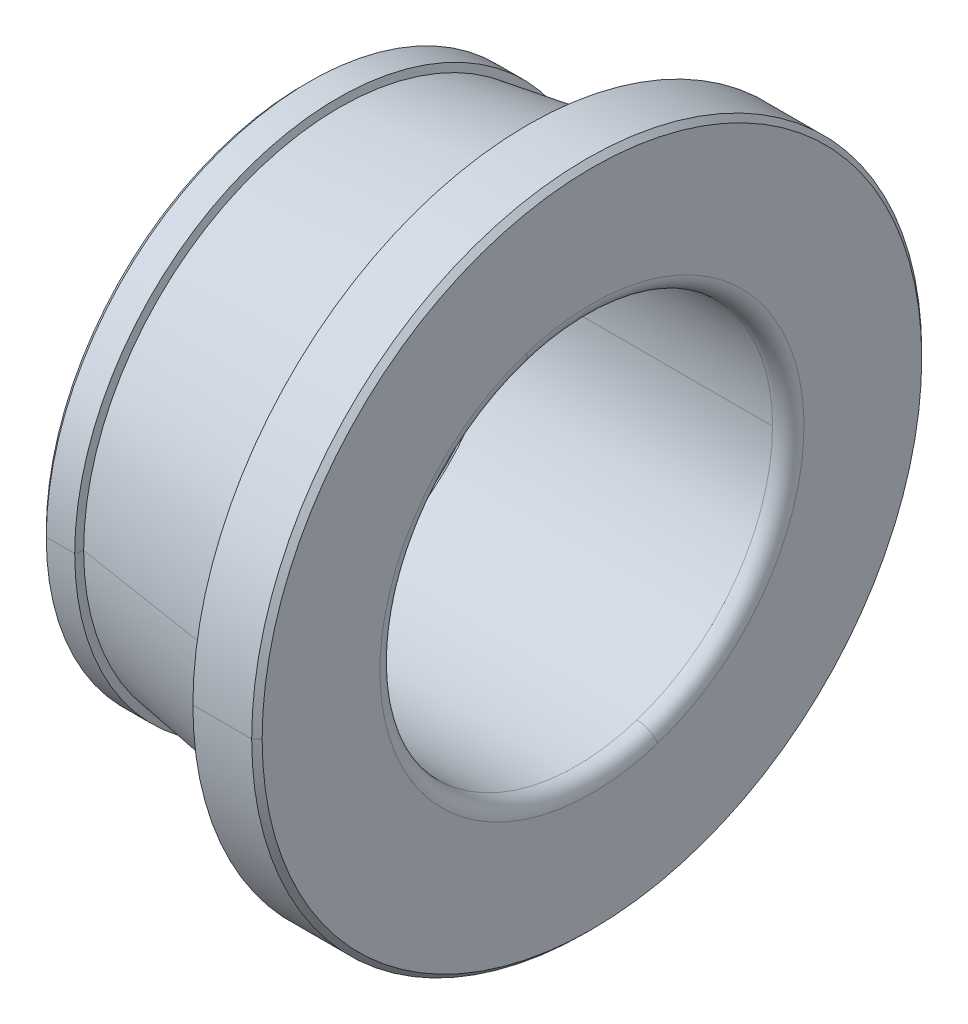
ISO-10303-21;
HEADER;
FILE_DESCRIPTION(('STEP AP214'),'2;1');
FILE_NAME('part.step','',(''),(''),'','','');
FILE_SCHEMA(('AUTOMOTIVE_DESIGN { 1 0 10303 214 1 1 1 1 }'));
ENDSEC;
DATA;
#1=APPLICATION_CONTEXT('core data for automotive mechanical design processes');
#2=APPLICATION_PROTOCOL_DEFINITION('international standard','automotive_design',2000,#1);
#3=PRODUCT_CONTEXT('',#1,'mechanical');
#4=PRODUCT('Part','Part','',(#3));
#5=PRODUCT_RELATED_PRODUCT_CATEGORY('part','',(#4));
#6=PRODUCT_DEFINITION_FORMATION('','',#4);
#7=PRODUCT_DEFINITION_CONTEXT('part definition',#1,'design');
#8=PRODUCT_DEFINITION('design','',#6,#7);
#9=PRODUCT_DEFINITION_SHAPE('','',#8);
#10=(LENGTH_UNIT() NAMED_UNIT(*) SI_UNIT(.MILLI.,.METRE.));
#11=(NAMED_UNIT(*) PLANE_ANGLE_UNIT() SI_UNIT($,.RADIAN.));
#12=(NAMED_UNIT(*) SI_UNIT($,.STERADIAN.) SOLID_ANGLE_UNIT());
#13=UNCERTAINTY_MEASURE_WITH_UNIT(LENGTH_MEASURE(1.E-05),#10,'distance_accuracy_value','');
#14=(GEOMETRIC_REPRESENTATION_CONTEXT(3) GLOBAL_UNCERTAINTY_ASSIGNED_CONTEXT((#13)) GLOBAL_UNIT_ASSIGNED_CONTEXT((#10,
#11,#12)) REPRESENTATION_CONTEXT('',''));
#15=CARTESIAN_POINT('',(0.,0.,0.));
#16=DIRECTION('',(0.,0.,1.));
#17=DIRECTION('',(1.,0.,0.));
#18=AXIS2_PLACEMENT_3D('',#15,#16,#17);
#19=CARTESIAN_POINT('',(0.75,9.848,0.));
#20=DIRECTION('',(-1.,0.,0.));
#21=DIRECTION('',(0.,0.,1.));
#22=AXIS2_PLACEMENT_3D('',#19,#20,#21);
#23=PLANE('',#22);
#24=CARTESIAN_POINT('',(0.75,0.,0.));
#25=DIRECTION('',(1.,0.,0.));
#26=DIRECTION('',(0.,0.,-1.));
#27=AXIS2_PLACEMENT_3D('',#24,#25,#26);
#28=CIRCLE('',#27,7.7);
#29=CARTESIAN_POINT('',(0.75,0.,-7.7));
#30=VERTEX_POINT('',#29);
#31=CARTESIAN_POINT('',(0.75,0.,7.7));
#32=VERTEX_POINT('',#31);
#33=EDGE_CURVE('E10',#30,#32,#28,.T.);
#34=ORIENTED_EDGE('',*,*,#33,.T.);
#35=CARTESIAN_POINT('',(0.75,0.,0.));
#36=DIRECTION('',(1.,0.,0.));
#37=DIRECTION('',(0.,0.,-1.));
#38=AXIS2_PLACEMENT_3D('',#35,#36,#37);
#39=CIRCLE('',#38,7.7);
#40=EDGE_CURVE('E24',#32,#30,#39,.T.);
#41=ORIENTED_EDGE('',*,*,#40,.T.);
#42=EDGE_LOOP('',(#34,#41));
#43=FACE_BOUND('',#42,.T.);
#44=CARTESIAN_POINT('',(0.75,0.,0.));
#45=DIRECTION('',(1.,0.,0.));
#46=DIRECTION('',(0.,0.,-1.));
#47=AXIS2_PLACEMENT_3D('',#44,#45,#46);
#48=CIRCLE('',#47,9.848);
#49=CARTESIAN_POINT('',(0.749999999999999,0.,9.848));
#50=VERTEX_POINT('',#49);
#51=CARTESIAN_POINT('',(0.75,0.,-9.848));
#52=VERTEX_POINT('',#51);
#53=EDGE_CURVE('E370',#50,#52,#48,.T.);
#54=ORIENTED_EDGE('',*,*,#53,.F.);
#55=CARTESIAN_POINT('',(0.75,0.,0.));
#56=DIRECTION('',(1.,0.,0.));
#57=DIRECTION('',(0.,0.,-1.));
#58=AXIS2_PLACEMENT_3D('',#55,#56,#57);
#59=CIRCLE('',#58,9.848);
#60=EDGE_CURVE('E365',#52,#50,#59,.T.);
#61=ORIENTED_EDGE('',*,*,#60,.F.);
#62=EDGE_LOOP('',(#54,#61));
#63=FACE_BOUND('',#62,.T.);
#64=ADVANCED_FACE('F16',(#43,#63),#23,.T.);
#65=CARTESIAN_POINT('',(0.95,0.,0.));
#66=DIRECTION('',(1.,0.,0.));
#67=DIRECTION('',(0.,-1.,0.));
#68=AXIS2_PLACEMENT_3D('',#65,#66,#67);
#69=CONICAL_SURFACE('',#68,10.048,0.785398163397448);
#70=DIRECTION('',(0.707106781186548,0.,0.707106781186548));
#71=VECTOR('',#70,1.);
#72=CARTESIAN_POINT('',(0.749999999999999,0.,9.848));
#73=LINE('',#72,#71);
#74=CARTESIAN_POINT('',(0.949999999999999,0.,10.048));
#75=VERTEX_POINT('',#74);
#76=EDGE_CURVE('E361',#50,#75,#73,.T.);
#77=ORIENTED_EDGE('',*,*,#76,.T.);
#78=CARTESIAN_POINT('',(0.95,0.,0.));
#79=DIRECTION('',(1.,0.,0.));
#80=DIRECTION('',(0.,0.,-1.));
#81=AXIS2_PLACEMENT_3D('',#78,#79,#80);
#82=CIRCLE('',#81,10.048);
#83=CARTESIAN_POINT('',(0.95,0.,-10.048));
#84=VERTEX_POINT('',#83);
#85=EDGE_CURVE('E356',#84,#75,#82,.T.);
#86=ORIENTED_EDGE('',*,*,#85,.F.);
#87=DIRECTION('',(0.707106781186548,0.,-0.707106781186548));
#88=VECTOR('',#87,1.);
#89=CARTESIAN_POINT('',(0.749999999999999,0.,-9.848));
#90=LINE('',#89,#88);
#91=EDGE_CURVE('E351',#52,#84,#90,.T.);
#92=ORIENTED_EDGE('',*,*,#91,.F.);
#93=ORIENTED_EDGE('',*,*,#60,.T.);
#94=EDGE_LOOP('',(#77,#86,#92,#93));
#95=FACE_BOUND('',#94,.T.);
#96=ADVANCED_FACE('F386',(#95),#69,.T.);
#97=CARTESIAN_POINT('',(0.95,0.,0.));
#98=DIRECTION('',(1.,0.,0.));
#99=DIRECTION('',(0.,1.,0.));
#100=AXIS2_PLACEMENT_3D('',#97,#98,#99);
#101=CONICAL_SURFACE('',#100,10.048,0.785398163397448);
#102=ORIENTED_EDGE('',*,*,#76,.F.);
#103=ORIENTED_EDGE('',*,*,#53,.T.);
#104=ORIENTED_EDGE('',*,*,#91,.T.);
#105=CARTESIAN_POINT('',(0.95,0.,0.));
#106=DIRECTION('',(1.,0.,0.));
#107=DIRECTION('',(0.,0.,-1.));
#108=AXIS2_PLACEMENT_3D('',#105,#106,#107);
#109=CIRCLE('',#108,10.048);
#110=EDGE_CURVE('E346',#75,#84,#109,.T.);
#111=ORIENTED_EDGE('',*,*,#110,.F.);
#112=EDGE_LOOP('',(#102,#103,#104,#111));
#113=FACE_BOUND('',#112,.T.);
#114=ADVANCED_FACE('F381',(#113),#101,.T.);
#115=CARTESIAN_POINT('',(11.75,0.,0.));
#116=DIRECTION('',(1.,0.,0.));
#117=DIRECTION('',(0.,1.,-7.04598063582105E-12));
#118=AXIS2_PLACEMENT_3D('',#115,#116,#117);
#119=CYLINDRICAL_SURFACE('',#118,10.048);
#120=DIRECTION('',(1.,0.,0.));
#121=VECTOR('',#120,1.);
#122=CARTESIAN_POINT('',(0.949999999999999,0.,10.048));
#123=LINE('',#122,#121);
#124=CARTESIAN_POINT('',(2.0365056005658,0.,10.048));
#125=VERTEX_POINT('',#124);
#126=EDGE_CURVE('E341',#75,#125,#123,.T.);
#127=ORIENTED_EDGE('',*,*,#126,.F.);
#128=ORIENTED_EDGE('',*,*,#110,.T.);
#129=DIRECTION('',(1.,0.,0.));
#130=VECTOR('',#129,1.);
#131=CARTESIAN_POINT('',(0.949999999999999,0.,-10.048));
#132=LINE('',#131,#130);
#133=CARTESIAN_POINT('',(2.0365056005658,0.,-10.048));
#134=VERTEX_POINT('',#133);
#135=EDGE_CURVE('E337',#84,#134,#132,.T.);
#136=ORIENTED_EDGE('',*,*,#135,.T.);
#137=CARTESIAN_POINT('',(2.0365056005658,0.,0.));
#138=DIRECTION('',(1.,0.,0.));
#139=DIRECTION('',(0.,0.,-1.));
#140=AXIS2_PLACEMENT_3D('',#137,#138,#139);
#141=CIRCLE('',#140,10.048);
#142=EDGE_CURVE('E332',#125,#134,#141,.T.);
#143=ORIENTED_EDGE('',*,*,#142,.F.);
#144=EDGE_LOOP('',(#127,#128,#136,#143));
#145=FACE_BOUND('',#144,.T.);
#146=ADVANCED_FACE('F393',(#145),#119,.T.);
#147=CARTESIAN_POINT('',(2.1006162076405,0.,0.));
#148=DIRECTION('',(-1.,0.,0.));
#149=DIRECTION('',(0.,1.,0.));
#150=AXIS2_PLACEMENT_3D('',#147,#148,#149);
#151=CONICAL_SURFACE('',#150,9.7703064521703,1.34390352403557);
#152=DIRECTION('',(-0.224951054343929,0.,-0.97437006478522));
#153=VECTOR('',#152,1.);
#154=CARTESIAN_POINT('',(2.1006162076405,0.,-9.7703064521703));
#155=LINE('',#154,#153);
#156=CARTESIAN_POINT('',(2.1006162076405,0.,-9.7703064521703));
#157=VERTEX_POINT('',#156);
#158=EDGE_CURVE('E327',#157,#134,#155,.T.);
#159=ORIENTED_EDGE('',*,*,#158,.F.);
#160=CARTESIAN_POINT('',(2.1006162076405,0.,0.));
#161=DIRECTION('',(1.,0.,0.));
#162=DIRECTION('',(0.,0.,-1.));
#163=AXIS2_PLACEMENT_3D('',#160,#161,#162);
#164=CIRCLE('',#163,9.7703064521703);
#165=CARTESIAN_POINT('',(2.1006162076405,0.,9.7703064521703));
#166=VERTEX_POINT('',#165);
#167=EDGE_CURVE('E322',#166,#157,#164,.T.);
#168=ORIENTED_EDGE('',*,*,#167,.F.);
#169=DIRECTION('',(-0.224951054343929,0.,0.97437006478522));
#170=VECTOR('',#169,1.);
#171=CARTESIAN_POINT('',(2.1006162076405,0.,9.7703064521703));
#172=LINE('',#171,#170);
#173=EDGE_CURVE('E317',#166,#125,#172,.T.);
#174=ORIENTED_EDGE('',*,*,#173,.T.);
#175=ORIENTED_EDGE('',*,*,#142,.T.);
#176=EDGE_LOOP('',(#159,#168,#174,#175));
#177=FACE_BOUND('',#176,.T.);
#178=ADVANCED_FACE('F395',(#177),#151,.T.);
#179=CARTESIAN_POINT('',(2.1006162076405,0.,0.));
#180=DIRECTION('',(-1.,0.,0.));
#181=DIRECTION('',(0.,-1.,0.));
#182=AXIS2_PLACEMENT_3D('',#179,#180,#181);
#183=CONICAL_SURFACE('',#182,9.7703064521703,1.34390352403557);
#184=ORIENTED_EDGE('',*,*,#158,.T.);
#185=CARTESIAN_POINT('',(2.0365056005658,0.,0.));
#186=DIRECTION('',(1.,0.,0.));
#187=DIRECTION('',(0.,0.,-1.));
#188=AXIS2_PLACEMENT_3D('',#185,#186,#187);
#189=CIRCLE('',#188,10.048);
#190=EDGE_CURVE('E312',#134,#125,#189,.T.);
#191=ORIENTED_EDGE('',*,*,#190,.T.);
#192=ORIENTED_EDGE('',*,*,#173,.F.);
#193=CARTESIAN_POINT('',(2.1006162076405,0.,0.));
#194=DIRECTION('',(1.,0.,0.));
#195=DIRECTION('',(0.,0.,-1.));
#196=AXIS2_PLACEMENT_3D('',#193,#194,#195);
#197=CIRCLE('',#196,9.7703064521703);
#198=EDGE_CURVE('E307',#157,#166,#197,.T.);
#199=ORIENTED_EDGE('',*,*,#198,.F.);
#200=EDGE_LOOP('',(#184,#191,#192,#199));
#201=FACE_BOUND('',#200,.T.);
#202=ADVANCED_FACE('F400',(#201),#183,.T.);
#203=CARTESIAN_POINT('',(9.7247521082979,0.,0.));
#204=DIRECTION('',(1.,0.,0.));
#205=DIRECTION('',(0.,-1.,0.));
#206=AXIS2_PLACEMENT_3D('',#203,#204,#205);
#207=CONICAL_SURFACE('',#206,10.97621415212,0.156870193169296);
#208=DIRECTION('',(0.987721082490204,0.,0.156227600648473));
#209=VECTOR('',#208,1.);
#210=CARTESIAN_POINT('',(2.10061620764049,0.,9.7703064521703));
#211=LINE('',#210,#209);
#212=CARTESIAN_POINT('',(9.7247521082979,0.,10.97621415212));
#213=VERTEX_POINT('',#212);
#214=EDGE_CURVE('E303',#166,#213,#211,.T.);
#215=ORIENTED_EDGE('',*,*,#214,.T.);
#216=CARTESIAN_POINT('',(9.7247521082979,0.,0.));
#217=DIRECTION('',(1.,0.,0.));
#218=DIRECTION('',(0.,0.,-1.));
#219=AXIS2_PLACEMENT_3D('',#216,#217,#218);
#220=CIRCLE('',#219,10.97621415212);
#221=CARTESIAN_POINT('',(9.7247521082979,0.,-10.97621415212));
#222=VERTEX_POINT('',#221);
#223=EDGE_CURVE('E298',#222,#213,#220,.T.);
#224=ORIENTED_EDGE('',*,*,#223,.F.);
#225=DIRECTION('',(0.987721082490204,0.,-0.156227600648473));
#226=VECTOR('',#225,1.);
#227=CARTESIAN_POINT('',(2.10061620764049,0.,-9.7703064521703));
#228=LINE('',#227,#226);
#229=EDGE_CURVE('E293',#157,#222,#228,.T.);
#230=ORIENTED_EDGE('',*,*,#229,.F.);
#231=ORIENTED_EDGE('',*,*,#198,.T.);
#232=EDGE_LOOP('',(#215,#224,#230,#231));
#233=FACE_BOUND('',#232,.T.);
#234=ADVANCED_FACE('F407',(#233),#207,.T.);
#235=CARTESIAN_POINT('',(9.7247521082979,0.,0.));
#236=DIRECTION('',(1.,0.,0.));
#237=DIRECTION('',(0.,1.,0.));
#238=AXIS2_PLACEMENT_3D('',#235,#236,#237);
#239=CONICAL_SURFACE('',#238,10.97621415212,0.156870193169296);
#240=ORIENTED_EDGE('',*,*,#214,.F.);
#241=ORIENTED_EDGE('',*,*,#167,.T.);
#242=ORIENTED_EDGE('',*,*,#229,.T.);
#243=CARTESIAN_POINT('',(9.7247521082979,0.,0.));
#244=DIRECTION('',(1.,0.,0.));
#245=DIRECTION('',(0.,0.,-1.));
#246=AXIS2_PLACEMENT_3D('',#243,#244,#245);
#247=CIRCLE('',#246,10.97621415212);
#248=EDGE_CURVE('E288',#213,#222,#247,.T.);
#249=ORIENTED_EDGE('',*,*,#248,.F.);
#250=EDGE_LOOP('',(#240,#241,#242,#249));
#251=FACE_BOUND('',#250,.T.);
#252=ADVANCED_FACE('F404',(#251),#239,.T.);
#253=CARTESIAN_POINT('',(9.3036979685974,0.,0.));
#254=DIRECTION('',(-1.,0.,0.));
#255=DIRECTION('',(0.,1.,0.));
#256=AXIS2_PLACEMENT_3D('',#253,#254,#255);
#257=CONICAL_SURFACE('',#256,12.8,1.34390352403561);
#258=DIRECTION('',(-0.224951054343887,0.,-0.97437006478523));
#259=VECTOR('',#258,1.);
#260=CARTESIAN_POINT('',(9.7247521082979,0.,-10.97621415212));
#261=LINE('',#260,#259);
#262=CARTESIAN_POINT('',(9.3036979685974,0.,-12.8));
#263=VERTEX_POINT('',#262);
#264=EDGE_CURVE('E284',#222,#263,#261,.T.);
#265=ORIENTED_EDGE('',*,*,#264,.T.);
#266=CARTESIAN_POINT('',(9.3036979685974,0.,0.));
#267=DIRECTION('',(1.,0.,0.));
#268=DIRECTION('',(0.,0.,-1.));
#269=AXIS2_PLACEMENT_3D('',#266,#267,#268);
#270=CIRCLE('',#269,12.8);
#271=CARTESIAN_POINT('',(9.3036979685974,0.,12.8));
#272=VERTEX_POINT('',#271);
#273=EDGE_CURVE('E279',#272,#263,#270,.T.);
#274=ORIENTED_EDGE('',*,*,#273,.F.);
#275=DIRECTION('',(-0.224951054343887,0.,0.97437006478523));
#276=VECTOR('',#275,1.);
#277=CARTESIAN_POINT('',(9.7247521082979,0.,10.97621415212));
#278=LINE('',#277,#276);
#279=EDGE_CURVE('E274',#213,#272,#278,.T.);
#280=ORIENTED_EDGE('',*,*,#279,.F.);
#281=ORIENTED_EDGE('',*,*,#248,.T.);
#282=EDGE_LOOP('',(#265,#274,#280,#281));
#283=FACE_BOUND('',#282,.T.);
#284=ADVANCED_FACE('F409',(#283),#257,.F.);
#285=CARTESIAN_POINT('',(9.3036979685974,0.,0.));
#286=DIRECTION('',(-1.,0.,0.));
#287=DIRECTION('',(0.,-1.,0.));
#288=AXIS2_PLACEMENT_3D('',#285,#286,#287);
#289=CONICAL_SURFACE('',#288,12.8,1.34390352403561);
#290=ORIENTED_EDGE('',*,*,#264,.F.);
#291=ORIENTED_EDGE('',*,*,#223,.T.);
#292=ORIENTED_EDGE('',*,*,#279,.T.);
#293=CARTESIAN_POINT('',(9.3036979685974,0.,0.));
#294=DIRECTION('',(1.,0.,0.));
#295=DIRECTION('',(0.,0.,-1.));
#296=AXIS2_PLACEMENT_3D('',#293,#294,#295);
#297=CIRCLE('',#296,12.8);
#298=EDGE_CURVE('E269',#263,#272,#297,.T.);
#299=ORIENTED_EDGE('',*,*,#298,.F.);
#300=EDGE_LOOP('',(#290,#291,#292,#299));
#301=FACE_BOUND('',#300,.T.);
#302=ADVANCED_FACE('F414',(#301),#289,.F.);
#303=CARTESIAN_POINT('',(11.75,0.,0.));
#304=DIRECTION('',(1.,0.,0.));
#305=DIRECTION('',(0.,-1.,-2.35773084743394E-12));
#306=AXIS2_PLACEMENT_3D('',#303,#304,#305);
#307=CYLINDRICAL_SURFACE('',#306,12.8);
#308=DIRECTION('',(1.,0.,0.));
#309=VECTOR('',#308,1.);
#310=CARTESIAN_POINT('',(9.3036979685974,0.,12.8));
#311=LINE('',#310,#309);
#312=CARTESIAN_POINT('',(11.55,0.,12.8));
#313=VERTEX_POINT('',#312);
#314=EDGE_CURVE('E265',#272,#313,#311,.T.);
#315=ORIENTED_EDGE('',*,*,#314,.T.);
#316=CARTESIAN_POINT('',(11.55,0.,0.));
#317=DIRECTION('',(1.,0.,0.));
#318=DIRECTION('',(0.,0.,-1.));
#319=AXIS2_PLACEMENT_3D('',#316,#317,#318);
#320=CIRCLE('',#319,12.8);
#321=CARTESIAN_POINT('',(11.55,0.,-12.8));
#322=VERTEX_POINT('',#321);
#323=EDGE_CURVE('E260',#322,#313,#320,.T.);
#324=ORIENTED_EDGE('',*,*,#323,.F.);
#325=DIRECTION('',(1.,0.,0.));
#326=VECTOR('',#325,1.);
#327=CARTESIAN_POINT('',(9.3036979685974,0.,-12.8));
#328=LINE('',#327,#326);
#329=EDGE_CURVE('E255',#263,#322,#328,.T.);
#330=ORIENTED_EDGE('',*,*,#329,.F.);
#331=ORIENTED_EDGE('',*,*,#298,.T.);
#332=EDGE_LOOP('',(#315,#324,#330,#331));
#333=FACE_BOUND('',#332,.T.);
#334=ADVANCED_FACE('F420',(#333),#307,.T.);
#335=CARTESIAN_POINT('',(11.75,0.,0.));
#336=DIRECTION('',(1.,0.,0.));
#337=DIRECTION('',(0.,1.,0.));
#338=AXIS2_PLACEMENT_3D('',#335,#336,#337);
#339=CYLINDRICAL_SURFACE('',#338,12.8);
#340=ORIENTED_EDGE('',*,*,#314,.F.);
#341=ORIENTED_EDGE('',*,*,#273,.T.);
#342=ORIENTED_EDGE('',*,*,#329,.T.);
#343=CARTESIAN_POINT('',(11.55,0.,0.));
#344=DIRECTION('',(1.,0.,0.));
#345=DIRECTION('',(0.,0.,-1.));
#346=AXIS2_PLACEMENT_3D('',#343,#344,#345);
#347=CIRCLE('',#346,12.8);
#348=EDGE_CURVE('E250',#313,#322,#347,.T.);
#349=ORIENTED_EDGE('',*,*,#348,.F.);
#350=EDGE_LOOP('',(#340,#341,#342,#349));
#351=FACE_BOUND('',#350,.T.);
#352=ADVANCED_FACE('F418',(#351),#339,.T.);
#353=CARTESIAN_POINT('',(11.75,0.,0.));
#354=DIRECTION('',(-1.,0.,0.));
#355=DIRECTION('',(0.,1.,0.));
#356=AXIS2_PLACEMENT_3D('',#353,#354,#355);
#357=CONICAL_SURFACE('',#356,12.6,0.785398163397452);
#358=DIRECTION('',(-0.707106781186544,0.,-0.707106781186551));
#359=VECTOR('',#358,1.);
#360=CARTESIAN_POINT('',(11.75,0.,-12.6));
#361=LINE('',#360,#359);
#362=CARTESIAN_POINT('',(11.75,0.,-12.6));
#363=VERTEX_POINT('',#362);
#364=EDGE_CURVE('E245',#363,#322,#361,.T.);
#365=ORIENTED_EDGE('',*,*,#364,.F.);
#366=CARTESIAN_POINT('',(11.75,0.,0.));
#367=DIRECTION('',(1.,0.,0.));
#368=DIRECTION('',(0.,0.,-1.));
#369=AXIS2_PLACEMENT_3D('',#366,#367,#368);
#370=CIRCLE('',#369,12.6);
#371=CARTESIAN_POINT('',(11.75,0.,12.6));
#372=VERTEX_POINT('',#371);
#373=EDGE_CURVE('E240',#372,#363,#370,.T.);
#374=ORIENTED_EDGE('',*,*,#373,.F.);
#375=DIRECTION('',(-0.707106781186544,0.,0.707106781186551));
#376=VECTOR('',#375,1.);
#377=CARTESIAN_POINT('',(11.75,0.,12.6));
#378=LINE('',#377,#376);
#379=EDGE_CURVE('E235',#372,#313,#378,.T.);
#380=ORIENTED_EDGE('',*,*,#379,.T.);
#381=ORIENTED_EDGE('',*,*,#348,.T.);
#382=EDGE_LOOP('',(#365,#374,#380,#381));
#383=FACE_BOUND('',#382,.T.);
#384=ADVANCED_FACE('F426',(#383),#357,.T.);
#385=CARTESIAN_POINT('',(11.75,0.,0.));
#386=DIRECTION('',(-1.,0.,0.));
#387=DIRECTION('',(0.,-1.,0.));
#388=AXIS2_PLACEMENT_3D('',#385,#386,#387);
#389=CONICAL_SURFACE('',#388,12.6,0.785398163397452);
#390=ORIENTED_EDGE('',*,*,#364,.T.);
#391=ORIENTED_EDGE('',*,*,#323,.T.);
#392=ORIENTED_EDGE('',*,*,#379,.F.);
#393=CARTESIAN_POINT('',(11.75,0.,0.));
#394=DIRECTION('',(1.,0.,0.));
#395=DIRECTION('',(0.,0.,-1.));
#396=AXIS2_PLACEMENT_3D('',#393,#394,#395);
#397=CIRCLE('',#396,12.6);
#398=EDGE_CURVE('E232',#363,#372,#397,.T.);
#399=ORIENTED_EDGE('',*,*,#398,.F.);
#400=EDGE_LOOP('',(#390,#391,#392,#399));
#401=FACE_BOUND('',#400,.T.);
#402=ADVANCED_FACE('F423',(#401),#389,.T.);
#403=CARTESIAN_POINT('',(11.75,8.1,0.));
#404=DIRECTION('',(1.,0.,0.));
#405=DIRECTION('',(0.,0.,-1.));
#406=AXIS2_PLACEMENT_3D('',#403,#404,#405);
#407=PLANE('',#406);
#408=ORIENTED_EDGE('',*,*,#398,.T.);
#409=ORIENTED_EDGE('',*,*,#373,.T.);
#410=EDGE_LOOP('',(#408,#409));
#411=FACE_BOUND('',#410,.T.);
#412=CARTESIAN_POINT('',(11.7499999999999,-7.70355778199074,-2.50303765443709));
#413=CARTESIAN_POINT('',(11.7499999999999,-7.66260455660226,-2.62908781995269));
#414=CARTESIAN_POINT('',(11.7499999999999,-7.61855244062061,-2.75413084334289));
#415=CARTESIAN_POINT('',(11.7499999999999,-7.52436810499772,-3.00190575739987));
#416=CARTESIAN_POINT('',(11.7499999999999,-7.47423588535647,-3.12463764806666));
#417=CARTESIAN_POINT('',(11.7499999999999,-7.36800901994112,-3.36749344820424));
#418=CARTESIAN_POINT('',(11.7499999999999,-7.31191437416701,-3.48761735767504));
#419=CARTESIAN_POINT('',(11.7499999999999,-7.19389862280587,-3.72496812166957));
#420=CARTESIAN_POINT('',(11.7499999999999,-7.13197751721883,-3.8421949761933));
#421=CARTESIAN_POINT('',(11.7499999999999,-7.00245779736046,-4.07346913605738));
#422=CARTESIAN_POINT('',(11.7499999999999,-6.93485918308913,-4.18751644139772));
#423=CARTESIAN_POINT('',(11.7499999999999,-6.79414735639346,-4.41215677558234));
#424=CARTESIAN_POINT('',(11.7499999999999,-6.72103414396913,-4.52274980442662));
#425=CARTESIAN_POINT('',(11.7499999999999,-6.56946924114418,-4.74021515126071));
#426=CARTESIAN_POINT('',(11.7499999999999,-6.49101755074355,-4.84708746925053));
#427=CARTESIAN_POINT('',(11.7499999999999,-6.32896469323513,-5.05685393122591));
#428=CARTESIAN_POINT('',(11.7499999999999,-6.24536352612734,-5.15974807521146));
#429=CARTESIAN_POINT('',(11.7499999999999,-6.07321311659315,-5.36131030773753));
#430=CARTESIAN_POINT('',(11.7499999999999,-5.98466387416676,-5.45997839627804));
#431=CARTESIAN_POINT('',(11.7499999999999,-5.80283063718334,-5.65285081796309));
#432=CARTESIAN_POINT('',(11.7499999999999,-5.70954664262631,-5.74705515110765));
#433=CARTESIAN_POINT('',(11.7499999999999,-5.51846863061298,-5.93077311547965));
#434=CARTESIAN_POINT('',(11.7499999999999,-5.42067461315667,-6.0202867467071));
#435=CARTESIAN_POINT('',(11.7499999999999,-5.22081214972059,-6.19440766107519));
#436=CARTESIAN_POINT('',(11.7499999999999,-5.11874370374083,-6.27901494421583));
#437=CARTESIAN_POINT('',(11.7499999999999,-4.91057827507847,-6.44311933605224));
#438=CARTESIAN_POINT('',(11.7499999999999,-4.80448129239586,-6.52261644474801));
#439=CARTESIAN_POINT('',(11.7499999999999,-4.58851438725365,-6.67630897219732));
#440=CARTESIAN_POINT('',(11.7499999999999,-4.47864446479406,-6.75050439095085));
#441=CARTESIAN_POINT('',(11.7499999999999,-4.25539636636413,-6.89341479525299));
#442=CARTESIAN_POINT('',(11.7499999999999,-4.1420181903938,-6.9621297808016));
#443=CARTESIAN_POINT('',(11.7499999999999,-3.91202672289919,-7.09391377827502));
#444=CARTESIAN_POINT('',(11.7499999999999,-3.7954134313749,-7.15698279019983));
#445=CARTESIAN_POINT('',(11.7499999999999,-3.55923266440575,-7.27732290165173));
#446=CARTESIAN_POINT('',(11.7499999999999,-3.43966518896088,-7.33459400117882));
#447=CARTESIAN_POINT('',(11.7499999999999,-3.19786410267178,-7.44320031674016));
#448=CARTESIAN_POINT('',(11.7499999999999,-3.07563049182755,-7.49453553277441));
#449=CARTESIAN_POINT('',(11.7499999999999,-2.82879160621466,-7.59114641031821));
#450=CARTESIAN_POINT('',(11.7499999999999,-2.704186331446,-7.63642207182776));
#451=CARTESIAN_POINT('',(11.7499999999999,-2.4529043030053,-7.72080476728791));
#452=CARTESIAN_POINT('',(11.7499999999999,-2.32622754933325,-7.7599118012385));
#453=CARTESIAN_POINT('',(11.7499999999999,-2.07110773848095,-7.83186302931058));
#454=CARTESIAN_POINT('',(11.7499999999999,-1.94266468130069,-7.86470722343206));
#455=CARTESIAN_POINT('',(11.7499999999999,-1.68432169400699,-7.92405364730546));
#456=CARTESIAN_POINT('',(11.7499999999999,-1.55442176389354,-7.95055587705738));
#457=CARTESIAN_POINT('',(11.7499999999999,-1.29347797104301,-7.99715452599886));
#458=CARTESIAN_POINT('',(11.7499999999999,-1.16243410830591,-8.01725094518842));
#459=CARTESIAN_POINT('',(11.7499999999999,-0.89951814635149,-8.05098955897112));
#460=CARTESIAN_POINT('',(11.7499999999999,-0.767646047134165,-8.06463175356425));
#461=CARTESIAN_POINT('',(11.7499999999999,-0.503391303656928,-8.08542905291242));
#462=CARTESIAN_POINT('',(11.7499999999999,-0.371008659397018,-8.09258415766744));
#463=CARTESIAN_POINT('',(11.7499999999999,-0.106051747219987,-8.1003900400653));
#464=CARTESIAN_POINT('',(11.7499999999999,0.0265225206971324,-8.10104081770814));
#465=CARTESIAN_POINT('',(11.7499999999999,0.291543297165039,-8.0958364781013));
#466=CARTESIAN_POINT('',(11.7499999999999,0.423989805715826,-8.08998136085162));
#467=CARTESIAN_POINT('',(11.7499999999999,0.688435988211021,-8.07177933695003));
#468=CARTESIAN_POINT('',(11.7499999999999,0.820435662155428,-8.05943243029813));
#469=CARTESIAN_POINT('',(11.7499999999999,1.08367017666153,-8.02827657237168));
#470=CARTESIAN_POINT('',(11.7499999999999,1.21490501722322,-8.00946762109714));
#471=CARTESIAN_POINT('',(11.7499999999999,1.47629370873816,-7.96543298633651));
#472=CARTESIAN_POINT('',(11.7499999999999,1.60644755969141,-7.94020730285042));
#473=CARTESIAN_POINT('',(11.7499999999999,1.86536071996239,-7.88339997454772));
#474=CARTESIAN_POINT('',(11.7499999999999,1.99412002928012,-7.85181832973111));
#475=CARTESIAN_POINT('',(11.7499999999999,2.24993391382593,-7.78237516171596));
#476=CARTESIAN_POINT('',(11.7499999999999,2.37698848905401,-7.74451363851742));
#477=CARTESIAN_POINT('',(11.7499999999999,2.62908681982012,-7.66260192546407));
#478=CARTESIAN_POINT('',(11.7499999999999,2.75413057535816,-7.61855173560927));
#479=CARTESIAN_POINT('',(11.7499999999999,3.00190602538456,-7.52436881000908));
#480=CARTESIAN_POINT('',(11.7499999999999,3.12463771987293,-7.4742360742637));
#481=CARTESIAN_POINT('',(11.7499999999999,3.36749337639794,-7.3680088310339));
#482=CARTESIAN_POINT('',(11.7499999999999,3.48761733843458,-7.31191432354948));
#483=CARTESIAN_POINT('',(11.7499999999999,3.72496814090999,-7.19389867342342));
#484=CARTESIAN_POINT('',(11.7499999999999,3.84219498134875,-7.13197753078178));
#485=CARTESIAN_POINT('',(11.7499999999999,4.07346913090191,-7.00245778379755));
#486=CARTESIAN_POINT('',(11.7499999999999,4.18751644001631,-6.93485917945496));
#487=CARTESIAN_POINT('',(11.7499999999999,4.41215677696373,-6.79414736002765));
#488=CARTESIAN_POINT('',(11.7499999999999,4.52274980479675,-6.72103414494292));
#489=CARTESIAN_POINT('',(11.7499999999999,4.74021515089055,-6.56946924017041));
#490=CARTESIAN_POINT('',(11.7499999999999,4.84708746915134,-6.49101755048264));
#491=CARTESIAN_POINT('',(11.7499999999999,5.05685393132507,-6.32896469349607));
#492=CARTESIAN_POINT('',(11.7499999999999,5.15974807523802,-6.24536352619726));
#493=CARTESIAN_POINT('',(11.7499999999999,5.36131030771093,-6.07321311652325));
#494=CARTESIAN_POINT('',(11.7499999999999,5.4599783962709,-5.98466387414804));
#495=CARTESIAN_POINT('',(11.7499999999999,5.6528508179702,-5.80283063720209));
#496=CARTESIAN_POINT('',(11.7499999999999,5.74705515110954,-5.70954664263135));
#497=CARTESIAN_POINT('',(11.7499999999999,5.93077311547772,-5.51846863060797));
#498=CARTESIAN_POINT('',(11.7499999999999,6.02028674670657,-5.42067461315534));
#499=CARTESIAN_POINT('',(11.7499999999999,6.19440766107569,-5.22081214972196));
#500=CARTESIAN_POINT('',(11.7499999999999,6.27901494421595,-5.11874370374121));
#501=CARTESIAN_POINT('',(11.7499999999999,6.44311933605209,-4.91057827507813));
#502=CARTESIAN_POINT('',(11.7499999999999,6.52261644474796,-4.80448129239578));
#503=CARTESIAN_POINT('',(11.7499999999999,6.67630897219734,-4.58851438725377));
#504=CARTESIAN_POINT('',(11.7499999999999,6.75050439095085,-4.47864446479411));
#505=CARTESIAN_POINT('',(11.7499999999999,6.89341479525297,-4.25539636636413));
#506=CARTESIAN_POINT('',(11.7499999999999,6.96212978080158,-4.14201819039382));
#507=CARTESIAN_POINT('',(11.7499999999999,7.09391377827501,-3.91202672289922));
#508=CARTESIAN_POINT('',(11.7499999999999,7.15698279019982,-3.79541343137493));
#509=CARTESIAN_POINT('',(11.7499999999999,7.27732290165172,-3.55923266440577));
#510=CARTESIAN_POINT('',(11.7499999999999,7.3345940011788,-3.4396651889609));
#511=CARTESIAN_POINT('',(11.7499999999999,7.44320031674016,-3.1978641026718));
#512=CARTESIAN_POINT('',(11.7499999999999,7.49453553277443,-3.07563049182757));
#513=CARTESIAN_POINT('',(11.7499999999999,7.59114641031818,-2.82879160621469));
#514=CARTESIAN_POINT('',(11.7499999999999,7.63642207182765,-2.70418633144605));
#515=CARTESIAN_POINT('',(11.7499999999999,7.720804767288,-2.45290430300529));
#516=CARTESIAN_POINT('',(11.7499999999999,7.75991180123887,-2.32622754933317));
#517=CARTESIAN_POINT('',(11.7499999999999,7.83186302931021,-2.07110773848107));
#518=CARTESIAN_POINT('',(11.7499999999999,7.86470722343067,-1.94266468130109));
#519=CARTESIAN_POINT('',(11.7499999999999,7.92405364730685,-1.68432169400663));
#520=CARTESIAN_POINT('',(11.7499999999999,7.95055587706256,-1.55442176389216));
#521=CARTESIAN_POINT('',(11.7499999999999,7.99715452599368,-1.29347797104443));
#522=CARTESIAN_POINT('',(11.7499999999999,8.01725094516908,-1.16243410831118));
#523=CARTESIAN_POINT('',(11.7499999999999,8.05098955899046,-0.899518146346263));
#524=CARTESIAN_POINT('',(11.7499999999999,8.06463175363644,-0.767646047114594));
#525=CARTESIAN_POINT('',(11.7499999999999,8.08542905284023,-0.503391303676549));
#526=CARTESIAN_POINT('',(11.7499999999999,8.09258415739805,-0.371008659470173));
#527=CARTESIAN_POINT('',(11.7499999999999,8.10039004033469,-0.106051747146888));
#528=CARTESIAN_POINT('',(11.7499999999999,8.10104081871351,0.0265225209700216));
#529=CARTESIAN_POINT('',(11.7499999999999,8.09583647709594,0.291543296892096));
#530=CARTESIAN_POINT('',(11.7499999999999,8.08998135709955,0.42398980469726));
#531=CARTESIAN_POINT('',(11.7499999999999,8.07177934070211,0.688435989229533));
#532=CARTESIAN_POINT('',(11.7499999999999,8.05943244430107,0.820435665956641));
#533=CARTESIAN_POINT('',(11.7499999999999,8.02827655836874,1.08367017286027));
#534=CARTESIAN_POINT('',(11.7499999999999,8.00946756883745,1.2149050030368));
#535=CARTESIAN_POINT('',(11.7499999999999,7.9654330385962,1.47629372292455));
#536=CARTESIAN_POINT('',(11.7499999999999,7.94020749788625,1.60644761263577));
#537=CARTESIAN_POINT('',(11.7499999999999,7.88339977951189,1.865360667018));
#538=CARTESIAN_POINT('',(11.7499999999999,7.85181760184749,1.99411983168901));
#539=CARTESIAN_POINT('',(11.7499999999999,7.78237588959959,2.249934111417));
#540=CARTESIAN_POINT('',(11.7499999999999,7.7445163550161,2.37698922647398));
#541=CARTESIAN_POINT('',(11.7499999999999,7.70355778199075,2.50303765443704));
#542=B_SPLINE_CURVE_WITH_KNOTS('',3,(#412,#413,#414,#415,#416,#417,#418,#419,#420,#421,#422,
#423,#424,#425,#426,#427,#428,#429,#430,#431,#432,#433,#434,#435,#436,#437,#438,#439,#440,#441,
#442,#443,#444,#445,#446,#447,#448,#449,#450,#451,#452,#453,#454,#455,#456,#457,#458,#459,#460,
#461,#462,#463,#464,#465,#466,#467,#468,#469,#470,#471,#472,#473,#474,#475,#476,#477,#478,#479,
#480,#481,#482,#483,#484,#485,#486,#487,#488,#489,#490,#491,#492,#493,#494,#495,#496,#497,#498,
#499,#500,#501,#502,#503,#504,#505,#506,#507,#508,#509,#510,#511,#512,#513,#514,#515,#516,#517,
#518,#519,#520,#521,#522,#523,#524,#525,#526,#527,#528,#529,#530,#531,#532,#533,#534,#535,#536,
#537,#538,#539,#540,#541),.UNSPECIFIED.,.F.,.F.,(4,2,2,2,2,2,2,2,2,2,2,2,2,2,2,2,2,2,2,2,2,2,2,
2,2,2,2,2,2,2,2,2,2,2,2,2,2,2,2,2,2,2,2,2,2,2,2,2,2,2,2,2,2,2,2,2,2,2,2,2,2,2,2,2,4),(0.,
0.397567902071177,0.795135804142357,1.19270370621353,1.59027160828471,1.98783951035589,
2.38540741242707,2.78297531449825,3.18054321656943,3.5781111186406,3.97567902071178,
4.37324692278296,4.77081482485414,5.16838272692532,5.56595062899649,5.96351853106767,
6.36108643313885,6.75865433521003,7.15622223728121,7.55379013935239,7.95135804142356,
8.34892594349474,8.74649384556592,9.1440617476371,9.54162964970828,9.93919755177946,
10.3367654538506,10.7343333559218,11.131901257993,11.5294691600642,11.9270370621353,
12.3246049642065,12.7221728662777,13.1197407683489,13.5173086704201,13.9148765724912,
14.3124444745624,14.7100123766336,15.1075802787048,15.505148180776,15.9027160828471,
16.3002839849183,16.6978518869895,17.0954197890607,17.4929876911318,17.890555593203,
18.2881234952742,18.6856913973454,19.0832592994166,19.4808272014877,19.8783951035589,
20.2759630056301,20.6735309077013,21.0710988097724,21.4686667118436,21.8662346139148,
22.263802515986,22.6613704180572,23.0589383201283,23.4565062221995,23.8540741242707,
24.2516420263419,24.6492099284131,25.0467778304842,25.4443457325554),.UNSPECIFIED.);
#543=CARTESIAN_POINT('',(11.7499999999999,-7.70355778199074,-2.50303765443707));
#544=VERTEX_POINT('',#543);
#545=CARTESIAN_POINT('',(11.7499999999999,7.70355778199074,2.50303765443707));
#546=VERTEX_POINT('',#545);
#547=EDGE_CURVE('E231',#544,#546,#542,.T.);
#548=ORIENTED_EDGE('',*,*,#547,.F.);
#549=CARTESIAN_POINT('',(11.7499999999999,7.70355778199074,2.50303765443709));
#550=CARTESIAN_POINT('',(11.7499999999999,7.66260455660226,2.6290878199527));
#551=CARTESIAN_POINT('',(11.7499999999999,7.61855244062061,2.75413084334289));
#552=CARTESIAN_POINT('',(11.7499999999999,7.52436810499772,3.00190575739988));
#553=CARTESIAN_POINT('',(11.7499999999999,7.47423588535647,3.12463764806666));
#554=CARTESIAN_POINT('',(11.7499999999999,7.36800901994112,3.36749344820424));
#555=CARTESIAN_POINT('',(11.7499999999999,7.31191437416701,3.48761735767504));
#556=CARTESIAN_POINT('',(11.7499999999999,7.19389862280587,3.72496812166957));
#557=CARTESIAN_POINT('',(11.7499999999999,7.13197751721883,3.84219497619331));
#558=CARTESIAN_POINT('',(11.7499999999999,7.00245779736046,4.07346913605739));
#559=CARTESIAN_POINT('',(11.7499999999999,6.93485918308913,4.18751644139773));
#560=CARTESIAN_POINT('',(11.7499999999999,6.79414735639346,4.41215677558235));
#561=CARTESIAN_POINT('',(11.7499999999999,6.72103414396913,4.52274980442662));
#562=CARTESIAN_POINT('',(11.7499999999999,6.56946924114417,4.74021515126072));
#563=CARTESIAN_POINT('',(11.7499999999999,6.49101755074355,4.84708746925053));
#564=CARTESIAN_POINT('',(11.7499999999999,6.32896469323513,5.05685393122591));
#565=CARTESIAN_POINT('',(11.7499999999999,6.24536352612733,5.15974807521146));
#566=CARTESIAN_POINT('',(11.7499999999999,6.07321311659315,5.36131030773753));
#567=CARTESIAN_POINT('',(11.7499999999999,5.98466387416676,5.45997839627804));
#568=CARTESIAN_POINT('',(11.7499999999999,5.80283063718334,5.6528508179631));
#569=CARTESIAN_POINT('',(11.7499999999999,5.70954664262631,5.74705515110765));
#570=CARTESIAN_POINT('',(11.7499999999999,5.51846863061297,5.93077311547965));
#571=CARTESIAN_POINT('',(11.7499999999999,5.42067461315666,6.0202867467071));
#572=CARTESIAN_POINT('',(11.7499999999999,5.22081214972059,6.1944076610752));
#573=CARTESIAN_POINT('',(11.7499999999999,5.11874370374083,6.27901494421583));
#574=CARTESIAN_POINT('',(11.7499999999999,4.91057827507846,6.44311933605224));
#575=CARTESIAN_POINT('',(11.7499999999999,4.80448129239585,6.52261644474802));
#576=CARTESIAN_POINT('',(11.7499999999999,4.58851438725365,6.67630897219732));
#577=CARTESIAN_POINT('',(11.7499999999999,4.47864446479405,6.75050439095085));
#578=CARTESIAN_POINT('',(11.7499999999999,4.25539636636413,6.89341479525299));
#579=CARTESIAN_POINT('',(11.7499999999999,4.1420181903938,6.9621297808016));
#580=CARTESIAN_POINT('',(11.7499999999999,3.91202672289918,7.09391377827502));
#581=CARTESIAN_POINT('',(11.7499999999999,3.7954134313749,7.15698279019983));
#582=CARTESIAN_POINT('',(11.7499999999999,3.55923266440574,7.27732290165173));
#583=CARTESIAN_POINT('',(11.7499999999999,3.43966518896087,7.33459400117882));
#584=CARTESIAN_POINT('',(11.7499999999999,3.19786410267177,7.44320031674016));
#585=CARTESIAN_POINT('',(11.7499999999999,3.07563049182755,7.49453553277441));
#586=CARTESIAN_POINT('',(11.7499999999999,2.82879160621466,7.59114641031821));
#587=CARTESIAN_POINT('',(11.7499999999999,2.704186331446,7.63642207182776));
#588=CARTESIAN_POINT('',(11.7499999999999,2.45290430300529,7.72080476728791));
#589=CARTESIAN_POINT('',(11.7499999999999,2.32622754933325,7.7599118012385));
#590=CARTESIAN_POINT('',(11.7499999999999,2.07110773848094,7.83186302931058));
#591=CARTESIAN_POINT('',(11.7499999999999,1.94266468130068,7.86470722343206));
#592=CARTESIAN_POINT('',(11.7499999999999,1.68432169400698,7.92405364730547));
#593=CARTESIAN_POINT('',(11.7499999999999,1.55442176389353,7.95055587705738));
#594=CARTESIAN_POINT('',(11.7499999999999,1.29347797104299,7.99715452599886));
#595=CARTESIAN_POINT('',(11.7499999999999,1.1624341083059,8.01725094518842));
#596=CARTESIAN_POINT('',(11.7499999999999,0.899518146351476,8.05098955897112));
#597=CARTESIAN_POINT('',(11.7499999999999,0.767646047134151,8.06463175356425));
#598=CARTESIAN_POINT('',(11.7499999999999,0.503391303656917,8.08542905291242));
#599=CARTESIAN_POINT('',(11.7499999999999,0.371008659397008,8.09258415766744));
#600=CARTESIAN_POINT('',(11.7499999999999,0.106051747219979,8.1003900400653));
#601=CARTESIAN_POINT('',(11.7499999999999,-0.0265225206971424,8.10104081770814));
#602=CARTESIAN_POINT('',(11.7499999999999,-0.29154329716505,8.0958364781013));
#603=CARTESIAN_POINT('',(11.7499999999999,-0.423989805715836,8.08998136085162));
#604=CARTESIAN_POINT('',(11.7499999999999,-0.68843598821103,8.07177933695003));
#605=CARTESIAN_POINT('',(11.7499999999999,-0.820435662155438,8.05943243029813));
#606=CARTESIAN_POINT('',(11.7499999999999,-1.08367017666154,8.02827657237168));
#607=CARTESIAN_POINT('',(11.7499999999999,-1.21490501722323,8.00946762109714));
#608=CARTESIAN_POINT('',(11.7499999999999,-1.47629370873817,7.96543298633651));
#609=CARTESIAN_POINT('',(11.7499999999999,-1.60644755969143,7.94020730285041));
#610=CARTESIAN_POINT('',(11.7499999999999,-1.86536071996241,7.88339997454771));
#611=CARTESIAN_POINT('',(11.7499999999999,-1.99412002928014,7.85181832973111));
#612=CARTESIAN_POINT('',(11.7499999999999,-2.24993391382594,7.78237516171596));
#613=CARTESIAN_POINT('',(11.7499999999999,-2.37698848905402,7.74451363851742));
#614=CARTESIAN_POINT('',(11.7499999999999,-2.62908681982013,7.66260192546407));
#615=CARTESIAN_POINT('',(11.7499999999999,-2.75413057535817,7.61855173560926));
#616=CARTESIAN_POINT('',(11.7499999999999,-3.00190602538458,7.52436881000908));
#617=CARTESIAN_POINT('',(11.7499999999999,-3.12463771987294,7.4742360742637));
#618=CARTESIAN_POINT('',(11.7499999999999,-3.36749337639795,7.3680088310339));
#619=CARTESIAN_POINT('',(11.7499999999999,-3.48761733843459,7.31191432354948));
#620=CARTESIAN_POINT('',(11.7499999999999,-3.72496814091,7.19389867342341));
#621=CARTESIAN_POINT('',(11.7499999999999,-3.84219498134875,7.13197753078177));
#622=CARTESIAN_POINT('',(11.7499999999999,-4.07346913090191,7.00245778379754));
#623=CARTESIAN_POINT('',(11.7499999999999,-4.18751644001631,6.93485917945496));
#624=CARTESIAN_POINT('',(11.7499999999999,-4.41215677696373,6.79414736002764));
#625=CARTESIAN_POINT('',(11.7499999999999,-4.52274980479676,6.72103414494291));
#626=CARTESIAN_POINT('',(11.7499999999999,-4.74021515089056,6.56946924017041));
#627=CARTESIAN_POINT('',(11.7499999999999,-4.84708746915135,6.49101755048263));
#628=CARTESIAN_POINT('',(11.7499999999999,-5.05685393132508,6.32896469349606));
#629=CARTESIAN_POINT('',(11.7499999999999,-5.15974807523803,6.24536352619726));
#630=CARTESIAN_POINT('',(11.7499999999999,-5.36131030771095,6.07321311652324));
#631=CARTESIAN_POINT('',(11.7499999999999,-5.45997839627091,5.98466387414803));
#632=CARTESIAN_POINT('',(11.7499999999999,-5.65285081797021,5.80283063720208));
#633=CARTESIAN_POINT('',(11.7499999999999,-5.74705515110955,5.70954664263134));
#634=CARTESIAN_POINT('',(11.7499999999999,-5.93077311547774,5.51846863060796));
#635=CARTESIAN_POINT('',(11.7499999999999,-6.02028674670658,5.42067461315533));
#636=CARTESIAN_POINT('',(11.7499999999999,-6.1944076610757,5.22081214972195));
#637=CARTESIAN_POINT('',(11.7499999999999,-6.27901494421596,5.1187437037412));
#638=CARTESIAN_POINT('',(11.7499999999999,-6.4431193360521,4.91057827507811));
#639=CARTESIAN_POINT('',(11.7499999999999,-6.52261644474797,4.80448129239577));
#640=CARTESIAN_POINT('',(11.7499999999999,-6.67630897219735,4.58851438725376));
#641=CARTESIAN_POINT('',(11.7499999999999,-6.75050439095086,4.47864446479409));
#642=CARTESIAN_POINT('',(11.7499999999999,-6.89341479525298,4.25539636636412));
#643=CARTESIAN_POINT('',(11.7499999999999,-6.96212978080159,4.1420181903938));
#644=CARTESIAN_POINT('',(11.7499999999999,-7.09391377827502,3.9120267228992));
#645=CARTESIAN_POINT('',(11.7499999999999,-7.15698279019983,3.79541343137491));
#646=CARTESIAN_POINT('',(11.7499999999999,-7.27732290165173,3.55923266440575));
#647=CARTESIAN_POINT('',(11.7499999999999,-7.33459400117881,3.43966518896088));
#648=CARTESIAN_POINT('',(11.7499999999999,-7.44320031674016,3.19786410267178));
#649=CARTESIAN_POINT('',(11.7499999999999,-7.49453553277443,3.07563049182755));
#650=CARTESIAN_POINT('',(11.7499999999999,-7.59114641031818,2.82879160621468));
#651=CARTESIAN_POINT('',(11.7499999999999,-7.63642207182766,2.70418633144604));
#652=CARTESIAN_POINT('',(11.7499999999999,-7.72080476728801,2.45290430300528));
#653=CARTESIAN_POINT('',(11.7499999999999,-7.75991180123888,2.32622754933316));
#654=CARTESIAN_POINT('',(11.7499999999999,-7.83186302931021,2.07110773848105));
#655=CARTESIAN_POINT('',(11.7499999999999,-7.86470722343067,1.94266468130107));
#656=CARTESIAN_POINT('',(11.7499999999999,-7.92405364730685,1.68432169400661));
#657=CARTESIAN_POINT('',(11.7499999999999,-7.95055587706257,1.55442176389214));
#658=CARTESIAN_POINT('',(11.7499999999999,-7.99715452599368,1.29347797104441));
#659=CARTESIAN_POINT('',(11.7499999999999,-8.01725094516908,1.16243410831116));
#660=CARTESIAN_POINT('',(11.7499999999999,-8.05098955899046,0.899518146346241));
#661=CARTESIAN_POINT('',(11.7499999999999,-8.06463175363644,0.767646047114572));
#662=CARTESIAN_POINT('',(11.7499999999999,-8.08542905284023,0.503391303676527));
#663=CARTESIAN_POINT('',(11.7499999999999,-8.09258415739805,0.371008659470151));
#664=CARTESIAN_POINT('',(11.7499999999999,-8.10039004033469,0.106051747146865));
#665=CARTESIAN_POINT('',(11.7499999999999,-8.10104081871351,-0.0265225209700441));
#666=CARTESIAN_POINT('',(11.7499999999999,-8.09583647709594,-0.291543296892118));
#667=CARTESIAN_POINT('',(11.7499999999999,-8.08998135709954,-0.423989804697283));
#668=CARTESIAN_POINT('',(11.7499999999999,-8.07177934070211,-0.688435989229555));
#669=CARTESIAN_POINT('',(11.7499999999999,-8.05943244430107,-0.820435665956663));
#670=CARTESIAN_POINT('',(11.7499999999999,-8.02827655836874,-1.0836701728603));
#671=CARTESIAN_POINT('',(11.7499999999999,-8.00946756883745,-1.21490500303682));
#672=CARTESIAN_POINT('',(11.7499999999999,-7.9654330385962,-1.47629372292457));
#673=CARTESIAN_POINT('',(11.7499999999999,-7.94020749788625,-1.60644761263579));
#674=CARTESIAN_POINT('',(11.7499999999999,-7.88339977951189,-1.86536066701802));
#675=CARTESIAN_POINT('',(11.7499999999999,-7.85181760184748,-1.99411983168903));
#676=CARTESIAN_POINT('',(11.7499999999999,-7.78237588959959,-2.24993411141702));
#677=CARTESIAN_POINT('',(11.7499999999999,-7.7445163550161,-2.37698922647401));
#678=CARTESIAN_POINT('',(11.7499999999999,-7.70355778199075,-2.50303765443707));
#679=B_SPLINE_CURVE_WITH_KNOTS('',3,(#549,#550,#551,#552,#553,#554,#555,#556,#557,#558,#559,
#560,#561,#562,#563,#564,#565,#566,#567,#568,#569,#570,#571,#572,#573,#574,#575,#576,#577,#578,
#579,#580,#581,#582,#583,#584,#585,#586,#587,#588,#589,#590,#591,#592,#593,#594,#595,#596,#597,
#598,#599,#600,#601,#602,#603,#604,#605,#606,#607,#608,#609,#610,#611,#612,#613,#614,#615,#616,
#617,#618,#619,#620,#621,#622,#623,#624,#625,#626,#627,#628,#629,#630,#631,#632,#633,#634,#635,
#636,#637,#638,#639,#640,#641,#642,#643,#644,#645,#646,#647,#648,#649,#650,#651,#652,#653,#654,
#655,#656,#657,#658,#659,#660,#661,#662,#663,#664,#665,#666,#667,#668,#669,#670,#671,#672,#673,
#674,#675,#676,#677,#678),.UNSPECIFIED.,.F.,.F.,(4,2,2,2,2,2,2,2,2,2,2,2,2,2,2,2,2,2,2,2,2,2,2,
2,2,2,2,2,2,2,2,2,2,2,2,2,2,2,2,2,2,2,2,2,2,2,2,2,2,2,2,2,2,2,2,2,2,2,2,2,2,2,2,2,4),(0.,
0.397567902071177,0.795135804142357,1.19270370621353,1.59027160828471,1.98783951035589,
2.38540741242707,2.78297531449825,3.18054321656943,3.57811111864061,3.97567902071179,
4.37324692278297,4.77081482485414,5.16838272692532,5.5659506289965,5.96351853106768,
6.36108643313886,6.75865433521004,7.15622223728122,7.55379013935239,7.95135804142357,
8.34892594349475,8.74649384556593,9.14406174763711,9.54162964970829,9.93919755177947,
10.3367654538506,10.7343333559218,11.131901257993,11.5294691600642,11.9270370621354,
12.3246049642065,12.7221728662777,13.1197407683489,13.5173086704201,13.9148765724913,
14.3124444745624,14.7100123766336,15.1075802787048,15.505148180776,15.9027160828471,
16.3002839849183,16.6978518869895,17.0954197890607,17.4929876911319,17.890555593203,
18.2881234952742,18.6856913973454,19.0832592994166,19.4808272014878,19.8783951035589,
20.2759630056301,20.6735309077013,21.0710988097725,21.4686667118436,21.8662346139148,
22.263802515986,22.6613704180572,23.0589383201284,23.4565062221995,23.8540741242707,
24.2516420263419,24.6492099284131,25.0467778304842,25.4443457325554),.UNSPECIFIED.);
#680=EDGE_CURVE('E196',#546,#544,#679,.T.);
#681=ORIENTED_EDGE('',*,*,#680,.F.);
#682=EDGE_LOOP('',(#548,#681));
#683=FACE_BOUND('',#682,.T.);
#684=ADVANCED_FACE('F181',(#411,#683),#407,.T.);
#685=CARTESIAN_POINT('',(11.15,0.,0.));
#686=DIRECTION('',(1.,0.,0.));
#687=DIRECTION('',(0.,0.309016994374947,-0.951056516295154));
#688=AXIS2_PLACEMENT_3D('',#685,#686,#687);
#689=TOROIDAL_SURFACE('',#688,8.1,0.599999999999929);
#690=CARTESIAN_POINT('',(11.15,-7.70355778199074,-2.50303765443707));
#691=DIRECTION('',(0.,0.309016994374947,-0.951056516295154));
#692=DIRECTION('',(0.,0.951056516295154,0.309016994374947));
#693=AXIS2_PLACEMENT_3D('',#690,#691,#692);
#694=CIRCLE('',#693,0.599999999999929);
#695=CARTESIAN_POINT('',(11.15,-7.13292387221372,-2.31762745781213));
#696=VERTEX_POINT('',#695);
#697=EDGE_CURVE('E205',#696,#544,#694,.T.);
#698=ORIENTED_EDGE('',*,*,#697,.F.);
#699=CARTESIAN_POINT('',(11.15,0.,0.));
#700=DIRECTION('',(1.,0.,0.));
#701=DIRECTION('',(0.,0.,-1.));
#702=AXIS2_PLACEMENT_3D('',#699,#700,#701);
#703=CIRCLE('',#702,7.5);
#704=CARTESIAN_POINT('',(11.15,0.,7.5));
#705=VERTEX_POINT('',#704);
#706=EDGE_CURVE('E201',#705,#696,#703,.T.);
#707=ORIENTED_EDGE('',*,*,#706,.F.);
#708=CARTESIAN_POINT('',(11.15,0.,0.));
#709=DIRECTION('',(1.,0.,0.));
#710=DIRECTION('',(0.,0.,-1.));
#711=AXIS2_PLACEMENT_3D('',#708,#709,#710);
#712=CIRCLE('',#711,7.5);
#713=CARTESIAN_POINT('',(11.15,7.13292387221372,2.31762745781213));
#714=VERTEX_POINT('',#713);
#715=EDGE_CURVE('E127',#714,#705,#712,.T.);
#716=ORIENTED_EDGE('',*,*,#715,.F.);
#717=CARTESIAN_POINT('',(11.15,7.70355778199074,2.50303765443707));
#718=DIRECTION('',(0.,-0.309016994374947,0.951056516295154));
#719=DIRECTION('',(0.,-0.951056516295154,-0.309016994374947));
#720=AXIS2_PLACEMENT_3D('',#717,#718,#719);
#721=CIRCLE('',#720,0.599999999999929);
#722=EDGE_CURVE('E156',#714,#546,#721,.T.);
#723=ORIENTED_EDGE('',*,*,#722,.T.);
#724=ORIENTED_EDGE('',*,*,#680,.T.);
#725=EDGE_LOOP('',(#698,#707,#716,#723,#724));
#726=FACE_BOUND('',#725,.T.);
#727=ADVANCED_FACE('F175',(#726),#689,.T.);
#728=CARTESIAN_POINT('',(11.15,0.,0.));
#729=DIRECTION('',(1.,0.,0.));
#730=DIRECTION('',(0.,-0.309016994374947,0.951056516295154));
#731=AXIS2_PLACEMENT_3D('',#728,#729,#730);
#732=TOROIDAL_SURFACE('',#731,8.1,0.599999999999929);
#733=ORIENTED_EDGE('',*,*,#697,.T.);
#734=ORIENTED_EDGE('',*,*,#547,.T.);
#735=ORIENTED_EDGE('',*,*,#722,.F.);
#736=CARTESIAN_POINT('',(11.15,0.,0.));
#737=DIRECTION('',(1.,0.,0.));
#738=DIRECTION('',(0.,0.,-1.));
#739=AXIS2_PLACEMENT_3D('',#736,#737,#738);
#740=CIRCLE('',#739,7.5);
#741=CARTESIAN_POINT('',(11.15,0.,-7.5));
#742=VERTEX_POINT('',#741);
#743=EDGE_CURVE('E152',#742,#714,#740,.T.);
#744=ORIENTED_EDGE('',*,*,#743,.F.);
#745=CARTESIAN_POINT('',(11.15,0.,0.));
#746=DIRECTION('',(1.,0.,0.));
#747=DIRECTION('',(0.,0.,-1.));
#748=AXIS2_PLACEMENT_3D('',#745,#746,#747);
#749=CIRCLE('',#748,7.5);
#750=EDGE_CURVE('E128',#696,#742,#749,.T.);
#751=ORIENTED_EDGE('',*,*,#750,.F.);
#752=EDGE_LOOP('',(#733,#734,#735,#744,#751));
#753=FACE_BOUND('',#752,.T.);
#754=ADVANCED_FACE('F165',(#753),#732,.T.);
#755=CARTESIAN_POINT('',(11.75,0.,0.));
#756=DIRECTION('',(1.,0.,0.));
#757=DIRECTION('',(0.,1.,0.));
#758=AXIS2_PLACEMENT_3D('',#755,#756,#757);
#759=CYLINDRICAL_SURFACE('',#758,7.5);
#760=DIRECTION('',(1.,0.,0.));
#761=VECTOR('',#760,1.);
#762=CARTESIAN_POINT('',(0.949999999999999,0.,7.5));
#763=LINE('',#762,#761);
#764=CARTESIAN_POINT('',(0.95,0.,7.5));
#765=VERTEX_POINT('',#764);
#766=EDGE_CURVE('E111',#765,#705,#763,.T.);
#767=ORIENTED_EDGE('',*,*,#766,.T.);
#768=ORIENTED_EDGE('',*,*,#706,.T.);
#769=ORIENTED_EDGE('',*,*,#750,.T.);
#770=DIRECTION('',(1.,0.,0.));
#771=VECTOR('',#770,1.);
#772=CARTESIAN_POINT('',(0.949999999999999,0.,-7.5));
#773=LINE('',#772,#771);
#774=CARTESIAN_POINT('',(0.95,0.,-7.5));
#775=VERTEX_POINT('',#774);
#776=EDGE_CURVE('E114',#775,#742,#773,.T.);
#777=ORIENTED_EDGE('',*,*,#776,.F.);
#778=CARTESIAN_POINT('',(0.95,0.,0.));
#779=DIRECTION('',(1.,0.,0.));
#780=DIRECTION('',(0.,0.,-1.));
#781=AXIS2_PLACEMENT_3D('',#778,#779,#780);
#782=CIRCLE('',#781,7.5);
#783=EDGE_CURVE('E107',#765,#775,#782,.T.);
#784=ORIENTED_EDGE('',*,*,#783,.F.);
#785=EDGE_LOOP('',(#767,#768,#769,#777,#784));
#786=FACE_BOUND('',#785,.T.);
#787=ADVANCED_FACE('F109',(#786),#759,.F.);
#788=CARTESIAN_POINT('',(0.75,0.,0.));
#789=DIRECTION('',(-1.,0.,0.));
#790=DIRECTION('',(0.,1.,0.));
#791=AXIS2_PLACEMENT_3D('',#788,#789,#790);
#792=CONICAL_SURFACE('',#791,7.7,0.785398163397452);
#793=DIRECTION('',(-0.707106781186544,0.,-0.707106781186551));
#794=VECTOR('',#793,1.);
#795=CARTESIAN_POINT('',(0.95,0.,-7.5));
#796=LINE('',#795,#794);
#797=EDGE_CURVE('E118',#775,#30,#796,.T.);
#798=ORIENTED_EDGE('',*,*,#797,.T.);
#799=ORIENTED_EDGE('',*,*,#40,.F.);
#800=DIRECTION('',(-0.707106781186544,0.,0.707106781186551));
#801=VECTOR('',#800,1.);
#802=CARTESIAN_POINT('',(0.95,0.,7.5));
#803=LINE('',#802,#801);
#804=EDGE_CURVE('E132',#765,#32,#803,.T.);
#805=ORIENTED_EDGE('',*,*,#804,.F.);
#806=ORIENTED_EDGE('',*,*,#783,.T.);
#807=EDGE_LOOP('',(#798,#799,#805,#806));
#808=FACE_BOUND('',#807,.T.);
#809=ADVANCED_FACE('F134',(#808),#792,.F.);
#810=CARTESIAN_POINT('',(0.75,0.,0.));
#811=DIRECTION('',(-1.,0.,0.));
#812=DIRECTION('',(0.,-1.,0.));
#813=AXIS2_PLACEMENT_3D('',#810,#811,#812);
#814=CONICAL_SURFACE('',#813,7.7,0.785398163397452);
#815=ORIENTED_EDGE('',*,*,#797,.F.);
#816=CARTESIAN_POINT('',(0.95,0.,0.));
#817=DIRECTION('',(1.,0.,0.));
#818=DIRECTION('',(0.,0.,-1.));
#819=AXIS2_PLACEMENT_3D('',#816,#817,#818);
#820=CIRCLE('',#819,7.5);
#821=EDGE_CURVE('E124',#775,#765,#820,.T.);
#822=ORIENTED_EDGE('',*,*,#821,.T.);
#823=ORIENTED_EDGE('',*,*,#804,.T.);
#824=ORIENTED_EDGE('',*,*,#33,.F.);
#825=EDGE_LOOP('',(#815,#822,#823,#824));
#826=FACE_BOUND('',#825,.T.);
#827=ADVANCED_FACE('F131',(#826),#814,.F.);
#828=CARTESIAN_POINT('',(11.75,0.,0.));
#829=DIRECTION('',(1.,0.,0.));
#830=DIRECTION('',(0.,-1.,-2.45264421585441E-11));
#831=AXIS2_PLACEMENT_3D('',#828,#829,#830);
#832=CYLINDRICAL_SURFACE('',#831,7.5);
#833=ORIENTED_EDGE('',*,*,#766,.F.);
#834=ORIENTED_EDGE('',*,*,#821,.F.);
#835=ORIENTED_EDGE('',*,*,#776,.T.);
#836=ORIENTED_EDGE('',*,*,#743,.T.);
#837=ORIENTED_EDGE('',*,*,#715,.T.);
#838=EDGE_LOOP('',(#833,#834,#835,#836,#837));
#839=FACE_BOUND('',#838,.T.);
#840=ADVANCED_FACE('F123',(#839),#832,.F.);
#841=CARTESIAN_POINT('',(11.75,0.,0.));
#842=DIRECTION('',(1.,0.,0.));
#843=DIRECTION('',(0.,-1.,0.));
#844=AXIS2_PLACEMENT_3D('',#841,#842,#843);
#845=CYLINDRICAL_SURFACE('',#844,10.048);
#846=ORIENTED_EDGE('',*,*,#126,.T.);
#847=ORIENTED_EDGE('',*,*,#190,.F.);
#848=ORIENTED_EDGE('',*,*,#135,.F.);
#849=ORIENTED_EDGE('',*,*,#85,.T.);
#850=EDGE_LOOP('',(#846,#847,#848,#849));
#851=FACE_BOUND('',#850,.T.);
#852=ADVANCED_FACE('F389',(#851),#845,.T.);
#853=CLOSED_SHELL('',(#64,#96,#114,#146,#178,#202,#234,#252,#284,#302,#334,#352,#384,#402,#684,
#727,#754,#787,#809,#827,#840,#852));
#854=MANIFOLD_SOLID_BREP('B1',#853);
#855=ADVANCED_BREP_SHAPE_REPRESENTATION('',(#18,#854),#14);
#856=SHAPE_DEFINITION_REPRESENTATION(#9,#855);
ENDSEC;
END-ISO-10303-21;
